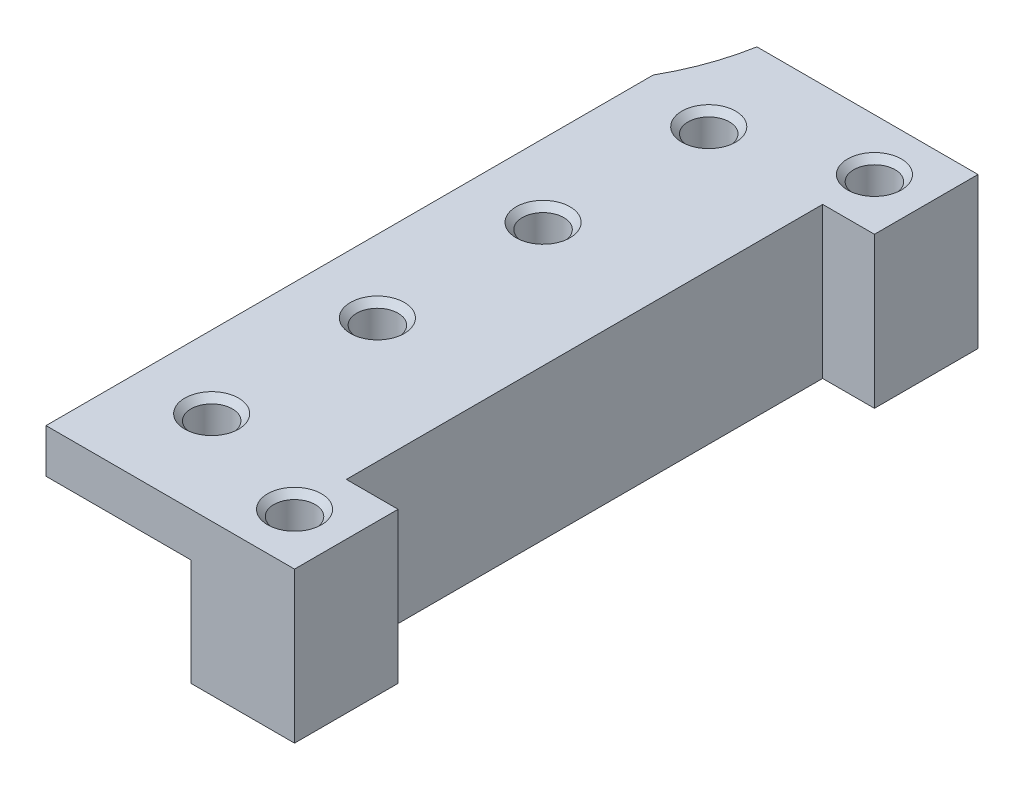
ISO-10303-21;
HEADER;
FILE_DESCRIPTION(('STEP AP214'),'2;1');
FILE_NAME('part.step','',(''),(''),'','','');
FILE_SCHEMA(('AUTOMOTIVE_DESIGN { 1 0 10303 214 1 1 1 1 }'));
ENDSEC;
DATA;
#1=APPLICATION_CONTEXT('core data for automotive mechanical design processes');
#2=APPLICATION_PROTOCOL_DEFINITION('international standard','automotive_design',2000,#1);
#3=PRODUCT_CONTEXT('',#1,'mechanical');
#4=PRODUCT('Part','Part','',(#3));
#5=PRODUCT_RELATED_PRODUCT_CATEGORY('part','',(#4));
#6=PRODUCT_DEFINITION_FORMATION('','',#4);
#7=PRODUCT_DEFINITION_CONTEXT('part definition',#1,'design');
#8=PRODUCT_DEFINITION('design','',#6,#7);
#9=PRODUCT_DEFINITION_SHAPE('','',#8);
#10=(LENGTH_UNIT() NAMED_UNIT(*) SI_UNIT(.MILLI.,.METRE.));
#11=(NAMED_UNIT(*) PLANE_ANGLE_UNIT() SI_UNIT($,.RADIAN.));
#12=(NAMED_UNIT(*) SI_UNIT($,.STERADIAN.) SOLID_ANGLE_UNIT());
#13=UNCERTAINTY_MEASURE_WITH_UNIT(LENGTH_MEASURE(1.E-05),#10,'distance_accuracy_value','');
#14=(GEOMETRIC_REPRESENTATION_CONTEXT(3) GLOBAL_UNCERTAINTY_ASSIGNED_CONTEXT((#13)) GLOBAL_UNIT_ASSIGNED_CONTEXT((#10,
#11,#12)) REPRESENTATION_CONTEXT('',''));
#15=CARTESIAN_POINT('',(0.,0.,0.));
#16=DIRECTION('',(0.,0.,1.));
#17=DIRECTION('',(1.,0.,0.));
#18=AXIS2_PLACEMENT_3D('',#15,#16,#17);
#19=CARTESIAN_POINT('',(0.,8.28,21.5));
#20=DIRECTION('',(0.,0.,1.));
#21=DIRECTION('',(1.,0.,0.));
#22=AXIS2_PLACEMENT_3D('',#19,#20,#21);
#23=PLANE('',#22);
#24=DIRECTION('',(0.,-1.,0.));
#25=VECTOR('',#24,1.);
#26=CARTESIAN_POINT('',(22.,8.28,21.5));
#27=LINE('',#26,#25);
#28=CARTESIAN_POINT('',(22.,7.28,21.5));
#29=VERTEX_POINT('',#28);
#30=CARTESIAN_POINT('',(22.,0.,21.5));
#31=VERTEX_POINT('',#30);
#32=EDGE_CURVE('E11',#29,#31,#27,.T.);
#33=ORIENTED_EDGE('',*,*,#32,.F.);
#34=DIRECTION('',(1.,0.,0.));
#35=VECTOR('',#34,1.);
#36=CARTESIAN_POINT('',(22.,7.28,21.5));
#37=LINE('',#36,#35);
#38=CARTESIAN_POINT('',(10.,7.28,21.5));
#39=VERTEX_POINT('',#38);
#40=EDGE_CURVE('E184',#39,#29,#37,.T.);
#41=ORIENTED_EDGE('',*,*,#40,.F.);
#42=DIRECTION('',(0.,-1.,0.));
#43=VECTOR('',#42,1.);
#44=CARTESIAN_POINT('',(10.,8.28,21.5));
#45=LINE('',#44,#43);
#46=CARTESIAN_POINT('',(10.,5.16,21.5));
#47=VERTEX_POINT('',#46);
#48=EDGE_CURVE('E231',#39,#47,#45,.T.);
#49=ORIENTED_EDGE('',*,*,#48,.T.);
#50=DIRECTION('',(-1.,0.,0.));
#51=VECTOR('',#50,1.);
#52=CARTESIAN_POINT('',(10.,5.16,21.5));
#53=LINE('',#52,#51);
#54=CARTESIAN_POINT('',(17.,5.16,21.5));
#55=VERTEX_POINT('',#54);
#56=EDGE_CURVE('E197',#55,#47,#53,.T.);
#57=ORIENTED_EDGE('',*,*,#56,.F.);
#58=DIRECTION('',(0.,1.,0.));
#59=VECTOR('',#58,1.);
#60=CARTESIAN_POINT('',(17.,0.,21.5));
#61=LINE('',#60,#59);
#62=CARTESIAN_POINT('',(17.,0.,21.5));
#63=VERTEX_POINT('',#62);
#64=EDGE_CURVE('E194',#63,#55,#61,.T.);
#65=ORIENTED_EDGE('',*,*,#64,.F.);
#66=DIRECTION('',(-1.,0.,0.));
#67=VECTOR('',#66,1.);
#68=CARTESIAN_POINT('',(0.,0.,21.5));
#69=LINE('',#68,#67);
#70=EDGE_CURVE('E213',#31,#63,#69,.T.);
#71=ORIENTED_EDGE('',*,*,#70,.F.);
#72=EDGE_LOOP('',(#33,#41,#49,#57,#65,#71));
#73=FACE_BOUND('',#72,.T.);
#74=ADVANCED_FACE('F34',(#73),#23,.T.);
#75=CARTESIAN_POINT('',(22.,8.28,0.));
#76=DIRECTION('',(-1.,0.,0.));
#77=DIRECTION('',(0.,0.,1.));
#78=AXIS2_PLACEMENT_3D('',#75,#76,#77);
#79=PLANE('',#78);
#80=DIRECTION('',(0.,0.,-1.));
#81=VECTOR('',#80,1.);
#82=CARTESIAN_POINT('',(22.,7.28,21.5));
#83=LINE('',#82,#81);
#84=CARTESIAN_POINT('',(22.,7.28,16.5));
#85=VERTEX_POINT('',#84);
#86=EDGE_CURVE('E124',#29,#85,#83,.T.);
#87=ORIENTED_EDGE('',*,*,#86,.F.);
#88=ORIENTED_EDGE('',*,*,#32,.T.);
#89=DIRECTION('',(0.,0.,-1.));
#90=VECTOR('',#89,1.);
#91=CARTESIAN_POINT('',(22.,0.,0.));
#92=LINE('',#91,#90);
#93=CARTESIAN_POINT('',(22.,0.,16.5));
#94=VERTEX_POINT('',#93);
#95=EDGE_CURVE('E216',#31,#94,#92,.T.);
#96=ORIENTED_EDGE('',*,*,#95,.T.);
#97=DIRECTION('',(0.,-1.,0.));
#98=VECTOR('',#97,1.);
#99=CARTESIAN_POINT('',(22.,8.28,16.5));
#100=LINE('',#99,#98);
#101=EDGE_CURVE('E42',#85,#94,#100,.T.);
#102=ORIENTED_EDGE('',*,*,#101,.F.);
#103=EDGE_LOOP('',(#87,#88,#96,#102));
#104=FACE_BOUND('',#103,.T.);
#105=ADVANCED_FACE('F254',(#104),#79,.F.);
#106=CARTESIAN_POINT('',(0.,8.28,16.5));
#107=DIRECTION('',(0.,0.,-1.));
#108=DIRECTION('',(-1.,0.,0.));
#109=AXIS2_PLACEMENT_3D('',#106,#107,#108);
#110=PLANE('',#109);
#111=DIRECTION('',(0.,-1.,0.));
#112=VECTOR('',#111,1.);
#113=CARTESIAN_POINT('',(19.5,8.28,16.5));
#114=LINE('',#113,#112);
#115=CARTESIAN_POINT('',(19.5,7.28,16.5));
#116=VERTEX_POINT('',#115);
#117=CARTESIAN_POINT('',(19.5,0.,16.5));
#118=VERTEX_POINT('',#117);
#119=EDGE_CURVE('E150',#116,#118,#114,.T.);
#120=ORIENTED_EDGE('',*,*,#119,.F.);
#121=DIRECTION('',(1.,0.,0.));
#122=VECTOR('',#121,1.);
#123=CARTESIAN_POINT('',(0.,7.28,16.5));
#124=LINE('',#123,#122);
#125=EDGE_CURVE('E191',#116,#85,#124,.T.);
#126=ORIENTED_EDGE('',*,*,#125,.T.);
#127=ORIENTED_EDGE('',*,*,#101,.T.);
#128=DIRECTION('',(1.,0.,0.));
#129=VECTOR('',#128,1.);
#130=CARTESIAN_POINT('',(0.,0.,16.5));
#131=LINE('',#130,#129);
#132=EDGE_CURVE('E219',#118,#94,#131,.T.);
#133=ORIENTED_EDGE('',*,*,#132,.F.);
#134=EDGE_LOOP('',(#120,#126,#127,#133));
#135=FACE_BOUND('',#134,.T.);
#136=ADVANCED_FACE('F259',(#135),#110,.T.);
#137=CARTESIAN_POINT('',(19.5,8.28,0.));
#138=DIRECTION('',(1.,0.,0.));
#139=DIRECTION('',(0.,0.,-1.));
#140=AXIS2_PLACEMENT_3D('',#137,#138,#139);
#141=PLANE('',#140);
#142=DIRECTION('',(0.,-1.,0.));
#143=VECTOR('',#142,1.);
#144=CARTESIAN_POINT('',(19.5,8.28,-6.5));
#145=LINE('',#144,#143);
#146=CARTESIAN_POINT('',(19.5,7.28,-6.5));
#147=VERTEX_POINT('',#146);
#148=CARTESIAN_POINT('',(19.5,0.,-6.5));
#149=VERTEX_POINT('',#148);
#150=EDGE_CURVE('E143',#147,#149,#145,.T.);
#151=ORIENTED_EDGE('',*,*,#150,.F.);
#152=DIRECTION('',(0.,0.,1.));
#153=VECTOR('',#152,1.);
#154=CARTESIAN_POINT('',(19.5,7.28,0.));
#155=LINE('',#154,#153);
#156=EDGE_CURVE('E188',#147,#116,#155,.T.);
#157=ORIENTED_EDGE('',*,*,#156,.T.);
#158=ORIENTED_EDGE('',*,*,#119,.T.);
#159=DIRECTION('',(0.,0.,1.));
#160=VECTOR('',#159,1.);
#161=CARTESIAN_POINT('',(19.5,0.,0.));
#162=LINE('',#161,#160);
#163=EDGE_CURVE('E222',#149,#118,#162,.T.);
#164=ORIENTED_EDGE('',*,*,#163,.F.);
#165=EDGE_LOOP('',(#151,#157,#158,#164));
#166=FACE_BOUND('',#165,.T.);
#167=ADVANCED_FACE('F276',(#166),#141,.T.);
#168=CARTESIAN_POINT('',(0.,8.28,-6.5));
#169=DIRECTION('',(0.,0.,-1.));
#170=DIRECTION('',(-1.,0.,0.));
#171=AXIS2_PLACEMENT_3D('',#168,#169,#170);
#172=PLANE('',#171);
#173=DIRECTION('',(1.,0.,0.));
#174=VECTOR('',#173,1.);
#175=CARTESIAN_POINT('',(0.,7.28,-6.5));
#176=LINE('',#175,#174);
#177=CARTESIAN_POINT('',(22.,7.28,-6.5));
#178=VERTEX_POINT('',#177);
#179=EDGE_CURVE('E120',#147,#178,#176,.T.);
#180=ORIENTED_EDGE('',*,*,#179,.F.);
#181=ORIENTED_EDGE('',*,*,#150,.T.);
#182=DIRECTION('',(1.,0.,0.));
#183=VECTOR('',#182,1.);
#184=CARTESIAN_POINT('',(0.,0.,-6.5));
#185=LINE('',#184,#183);
#186=CARTESIAN_POINT('',(22.,0.,-6.5));
#187=VERTEX_POINT('',#186);
#188=EDGE_CURVE('E225',#149,#187,#185,.T.);
#189=ORIENTED_EDGE('',*,*,#188,.T.);
#190=DIRECTION('',(0.,-1.,0.));
#191=VECTOR('',#190,1.);
#192=CARTESIAN_POINT('',(22.,8.28,-6.5));
#193=LINE('',#192,#191);
#194=EDGE_CURVE('E141',#178,#187,#193,.T.);
#195=ORIENTED_EDGE('',*,*,#194,.F.);
#196=EDGE_LOOP('',(#180,#181,#189,#195));
#197=FACE_BOUND('',#196,.T.);
#198=ADVANCED_FACE('F278',(#197),#172,.F.);
#199=CARTESIAN_POINT('',(22.,8.28,0.));
#200=DIRECTION('',(1.,0.,0.));
#201=DIRECTION('',(0.,0.,-1.));
#202=AXIS2_PLACEMENT_3D('',#199,#200,#201);
#203=PLANE('',#202);
#204=DIRECTION('',(0.,-1.,0.));
#205=VECTOR('',#204,1.);
#206=CARTESIAN_POINT('',(22.,8.28,-11.5));
#207=LINE('',#206,#205);
#208=CARTESIAN_POINT('',(22.,7.28,-11.5));
#209=VERTEX_POINT('',#208);
#210=CARTESIAN_POINT('',(22.,0.,-11.5));
#211=VERTEX_POINT('',#210);
#212=EDGE_CURVE('E131',#209,#211,#207,.T.);
#213=ORIENTED_EDGE('',*,*,#212,.F.);
#214=EDGE_CURVE('E115',#178,#209,#83,.T.);
#215=ORIENTED_EDGE('',*,*,#214,.F.);
#216=ORIENTED_EDGE('',*,*,#194,.T.);
#217=DIRECTION('',(0.,0.,1.));
#218=VECTOR('',#217,1.);
#219=CARTESIAN_POINT('',(22.,0.,0.));
#220=LINE('',#219,#218);
#221=EDGE_CURVE('E140',#211,#187,#220,.T.);
#222=ORIENTED_EDGE('',*,*,#221,.F.);
#223=EDGE_LOOP('',(#213,#215,#216,#222));
#224=FACE_BOUND('',#223,.T.);
#225=ADVANCED_FACE('F138',(#224),#203,.T.);
#226=CARTESIAN_POINT('',(0.,8.28,-11.5));
#227=DIRECTION('',(0.,0.,1.));
#228=DIRECTION('',(1.,0.,0.));
#229=AXIS2_PLACEMENT_3D('',#226,#227,#228);
#230=PLANE('',#229);
#231=DIRECTION('',(-1.,0.,0.));
#232=VECTOR('',#231,1.);
#233=CARTESIAN_POINT('',(22.,7.28,-11.5));
#234=LINE('',#233,#232);
#235=CARTESIAN_POINT('',(11.3247516529061,7.28,-11.5));
#236=VERTEX_POINT('',#235);
#237=EDGE_CURVE('E118',#209,#236,#234,.T.);
#238=ORIENTED_EDGE('',*,*,#237,.F.);
#239=ORIENTED_EDGE('',*,*,#212,.T.);
#240=DIRECTION('',(-1.,0.,0.));
#241=VECTOR('',#240,1.);
#242=CARTESIAN_POINT('',(0.,0.,-11.5));
#243=LINE('',#242,#241);
#244=CARTESIAN_POINT('',(17.,0.,-11.5));
#245=VERTEX_POINT('',#244);
#246=EDGE_CURVE('E229',#211,#245,#243,.T.);
#247=ORIENTED_EDGE('',*,*,#246,.T.);
#248=DIRECTION('',(0.,1.,0.));
#249=VECTOR('',#248,1.);
#250=CARTESIAN_POINT('',(17.,0.,-11.5));
#251=LINE('',#250,#249);
#252=CARTESIAN_POINT('',(17.,5.16,-11.5));
#253=VERTEX_POINT('',#252);
#254=EDGE_CURVE('E58',#245,#253,#251,.T.);
#255=ORIENTED_EDGE('',*,*,#254,.T.);
#256=DIRECTION('',(-1.,0.,0.));
#257=VECTOR('',#256,1.);
#258=CARTESIAN_POINT('',(10.,5.16,-11.5));
#259=LINE('',#258,#257);
#260=CARTESIAN_POINT('',(11.3247516529061,5.16,-11.5));
#261=VERTEX_POINT('',#260);
#262=EDGE_CURVE('E196',#253,#261,#259,.T.);
#263=ORIENTED_EDGE('',*,*,#262,.T.);
#264=DIRECTION('',(0.,-1.,0.));
#265=VECTOR('',#264,1.);
#266=CARTESIAN_POINT('',(11.3247516529061,8.28,-11.5));
#267=LINE('',#266,#265);
#268=EDGE_CURVE('E134',#236,#261,#267,.T.);
#269=ORIENTED_EDGE('',*,*,#268,.F.);
#270=EDGE_LOOP('',(#238,#239,#247,#255,#263,#269));
#271=FACE_BOUND('',#270,.T.);
#272=ADVANCED_FACE('F129',(#271),#230,.F.);
#273=CARTESIAN_POINT('',(0.,8.28,-13.5));
#274=DIRECTION('',(0.,-1.,0.));
#275=DIRECTION('',(0.,0.,-1.));
#276=AXIS2_PLACEMENT_3D('',#273,#274,#275);
#277=CYLINDRICAL_SURFACE('',#276,11.5);
#278=DIRECTION('',(0.,-1.,0.));
#279=VECTOR('',#278,1.);
#280=CARTESIAN_POINT('',(10.,8.28,-7.82109165419974));
#281=LINE('',#280,#279);
#282=CARTESIAN_POINT('',(10.,7.28,-7.82109165419974));
#283=VERTEX_POINT('',#282);
#284=CARTESIAN_POINT('',(10.,5.16,-7.82109165419974));
#285=VERTEX_POINT('',#284);
#286=EDGE_CURVE('E145',#283,#285,#281,.T.);
#287=ORIENTED_EDGE('',*,*,#286,.F.);
#288=CARTESIAN_POINT('',(0.,7.28,-13.5));
#289=DIRECTION('',(0.,1.,0.));
#290=DIRECTION('',(0.,0.,1.));
#291=AXIS2_PLACEMENT_3D('',#288,#289,#290);
#292=CIRCLE('',#291,11.5);
#293=EDGE_CURVE('E50',#283,#236,#292,.T.);
#294=ORIENTED_EDGE('',*,*,#293,.T.);
#295=ORIENTED_EDGE('',*,*,#268,.T.);
#296=CARTESIAN_POINT('',(0.,5.16,-13.5));
#297=DIRECTION('',(0.,1.,0.));
#298=DIRECTION('',(0.,0.,1.));
#299=AXIS2_PLACEMENT_3D('',#296,#297,#298);
#300=CIRCLE('',#299,11.5);
#301=EDGE_CURVE('E207',#285,#261,#300,.T.);
#302=ORIENTED_EDGE('',*,*,#301,.F.);
#303=EDGE_LOOP('',(#287,#294,#295,#302));
#304=FACE_BOUND('',#303,.T.);
#305=ADVANCED_FACE('F243',(#304),#277,.F.);
#306=CARTESIAN_POINT('',(10.,8.28,0.));
#307=DIRECTION('',(-1.,0.,0.));
#308=DIRECTION('',(0.,0.,1.));
#309=AXIS2_PLACEMENT_3D('',#306,#307,#308);
#310=PLANE('',#309);
#311=ORIENTED_EDGE('',*,*,#48,.F.);
#312=DIRECTION('',(0.,0.,1.));
#313=VECTOR('',#312,1.);
#314=CARTESIAN_POINT('',(10.,7.28,21.5));
#315=LINE('',#314,#313);
#316=EDGE_CURVE('E135',#283,#39,#315,.T.);
#317=ORIENTED_EDGE('',*,*,#316,.F.);
#318=ORIENTED_EDGE('',*,*,#286,.T.);
#319=DIRECTION('',(0.,0.,1.));
#320=VECTOR('',#319,1.);
#321=CARTESIAN_POINT('',(10.,5.16,-11.5));
#322=LINE('',#321,#320);
#323=EDGE_CURVE('E204',#285,#47,#322,.T.);
#324=ORIENTED_EDGE('',*,*,#323,.T.);
#325=EDGE_LOOP('',(#311,#317,#318,#324));
#326=FACE_BOUND('',#325,.T.);
#327=ADVANCED_FACE('F236',(#326),#310,.T.);
#328=CARTESIAN_POINT('',(0.,0.,0.));
#329=DIRECTION('',(0.,1.,0.));
#330=DIRECTION('',(0.,0.,1.));
#331=AXIS2_PLACEMENT_3D('',#328,#329,#330);
#332=PLANE('',#331);
#333=CARTESIAN_POINT('',(19.5,0.,19.));
#334=DIRECTION('',(0.,1.,0.));
#335=DIRECTION('',(0.,0.,1.));
#336=AXIS2_PLACEMENT_3D('',#333,#334,#335);
#337=CIRCLE('',#336,0.999999999999997);
#338=CARTESIAN_POINT('',(19.5,0.,20.));
#339=VERTEX_POINT('',#338);
#340=EDGE_CURVE('E299',#339,#339,#337,.T.);
#341=ORIENTED_EDGE('',*,*,#340,.T.);
#342=EDGE_LOOP('',(#341));
#343=FACE_BOUND('',#342,.T.);
#344=CARTESIAN_POINT('',(19.5,0.,-9.));
#345=DIRECTION('',(0.,1.,0.));
#346=DIRECTION('',(0.,0.,1.));
#347=AXIS2_PLACEMENT_3D('',#344,#345,#346);
#348=CIRCLE('',#347,0.999999999999997);
#349=CARTESIAN_POINT('',(19.5,0.,-8.));
#350=VERTEX_POINT('',#349);
#351=EDGE_CURVE('E302',#350,#350,#348,.T.);
#352=ORIENTED_EDGE('',*,*,#351,.T.);
#353=EDGE_LOOP('',(#352));
#354=FACE_BOUND('',#353,.T.);
#355=ORIENTED_EDGE('',*,*,#70,.T.);
#356=DIRECTION('',(0.,0.,1.));
#357=VECTOR('',#356,1.);
#358=CARTESIAN_POINT('',(17.,0.,-11.5));
#359=LINE('',#358,#357);
#360=EDGE_CURVE('E199',#245,#63,#359,.T.);
#361=ORIENTED_EDGE('',*,*,#360,.F.);
#362=ORIENTED_EDGE('',*,*,#246,.F.);
#363=ORIENTED_EDGE('',*,*,#221,.T.);
#364=ORIENTED_EDGE('',*,*,#188,.F.);
#365=ORIENTED_EDGE('',*,*,#163,.T.);
#366=ORIENTED_EDGE('',*,*,#132,.T.);
#367=ORIENTED_EDGE('',*,*,#95,.F.);
#368=EDGE_LOOP('',(#355,#361,#362,#363,#364,#365,#366,#367));
#369=FACE_BOUND('',#368,.T.);
#370=ADVANCED_FACE('F250',(#343,#354,#369),#332,.F.);
#371=CARTESIAN_POINT('',(10.,5.16,-11.5));
#372=DIRECTION('',(0.,1.,0.));
#373=DIRECTION('',(0.,0.,1.));
#374=AXIS2_PLACEMENT_3D('',#371,#372,#373);
#375=PLANE('',#374);
#376=CARTESIAN_POINT('',(13.5,5.16,17.));
#377=DIRECTION('',(0.,1.,0.));
#378=DIRECTION('',(0.,0.,1.));
#379=AXIS2_PLACEMENT_3D('',#376,#377,#378);
#380=CIRCLE('',#379,0.999999999999998);
#381=CARTESIAN_POINT('',(13.5,5.16,18.));
#382=VERTEX_POINT('',#381);
#383=EDGE_CURVE('E37',#382,#382,#380,.T.);
#384=ORIENTED_EDGE('',*,*,#383,.T.);
#385=EDGE_LOOP('',(#384));
#386=FACE_BOUND('',#385,.T.);
#387=CARTESIAN_POINT('',(13.5,5.16,9.));
#388=DIRECTION('',(0.,1.,0.));
#389=DIRECTION('',(0.,0.,1.));
#390=AXIS2_PLACEMENT_3D('',#387,#388,#389);
#391=CIRCLE('',#390,0.999999999999998);
#392=CARTESIAN_POINT('',(13.5,5.16,10.));
#393=VERTEX_POINT('',#392);
#394=EDGE_CURVE('E160',#393,#393,#391,.T.);
#395=ORIENTED_EDGE('',*,*,#394,.T.);
#396=EDGE_LOOP('',(#395));
#397=FACE_BOUND('',#396,.T.);
#398=CARTESIAN_POINT('',(13.5,5.16,1.));
#399=DIRECTION('',(0.,1.,0.));
#400=DIRECTION('',(0.,0.,1.));
#401=AXIS2_PLACEMENT_3D('',#398,#399,#400);
#402=CIRCLE('',#401,0.999999999999998);
#403=CARTESIAN_POINT('',(13.5,5.16,2.));
#404=VERTEX_POINT('',#403);
#405=EDGE_CURVE('E156',#404,#404,#402,.T.);
#406=ORIENTED_EDGE('',*,*,#405,.T.);
#407=EDGE_LOOP('',(#406));
#408=FACE_BOUND('',#407,.T.);
#409=CARTESIAN_POINT('',(13.5,5.16,-7.));
#410=DIRECTION('',(0.,1.,0.));
#411=DIRECTION('',(0.,0.,1.));
#412=AXIS2_PLACEMENT_3D('',#409,#410,#411);
#413=CIRCLE('',#412,0.999999999999998);
#414=CARTESIAN_POINT('',(13.5,5.16,-6.));
#415=VERTEX_POINT('',#414);
#416=EDGE_CURVE('E125',#415,#415,#413,.T.);
#417=ORIENTED_EDGE('',*,*,#416,.T.);
#418=EDGE_LOOP('',(#417));
#419=FACE_BOUND('',#418,.T.);
#420=ORIENTED_EDGE('',*,*,#301,.T.);
#421=ORIENTED_EDGE('',*,*,#262,.F.);
#422=DIRECTION('',(0.,0.,1.));
#423=VECTOR('',#422,1.);
#424=CARTESIAN_POINT('',(17.,5.16,-11.5));
#425=LINE('',#424,#423);
#426=EDGE_CURVE('E208',#253,#55,#425,.T.);
#427=ORIENTED_EDGE('',*,*,#426,.T.);
#428=ORIENTED_EDGE('',*,*,#56,.T.);
#429=ORIENTED_EDGE('',*,*,#323,.F.);
#430=EDGE_LOOP('',(#420,#421,#427,#428,#429));
#431=FACE_BOUND('',#430,.T.);
#432=ADVANCED_FACE('F240',(#386,#397,#408,#419,#431),#375,.F.);
#433=CARTESIAN_POINT('',(17.,0.,-11.5));
#434=DIRECTION('',(1.,0.,0.));
#435=DIRECTION('',(0.,0.,-1.));
#436=AXIS2_PLACEMENT_3D('',#433,#434,#435);
#437=PLANE('',#436);
#438=ORIENTED_EDGE('',*,*,#64,.T.);
#439=ORIENTED_EDGE('',*,*,#426,.F.);
#440=ORIENTED_EDGE('',*,*,#254,.F.);
#441=ORIENTED_EDGE('',*,*,#360,.T.);
#442=EDGE_LOOP('',(#438,#439,#440,#441));
#443=FACE_BOUND('',#442,.T.);
#444=ADVANCED_FACE('F279',(#443),#437,.F.);
#445=CARTESIAN_POINT('',(0.,7.28,0.));
#446=DIRECTION('',(0.,1.,0.));
#447=DIRECTION('',(0.,0.,1.));
#448=AXIS2_PLACEMENT_3D('',#445,#446,#447);
#449=PLANE('',#448);
#450=CARTESIAN_POINT('',(19.5,7.28,19.));
#451=DIRECTION('',(0.,1.,0.));
#452=DIRECTION('',(0.,0.,1.));
#453=AXIS2_PLACEMENT_3D('',#450,#451,#452);
#454=CIRCLE('',#453,1.3);
#455=CARTESIAN_POINT('',(19.5,7.28,20.3));
#456=VERTEX_POINT('',#455);
#457=EDGE_CURVE('E441',#456,#456,#454,.T.);
#458=ORIENTED_EDGE('',*,*,#457,.F.);
#459=EDGE_LOOP('',(#458));
#460=FACE_BOUND('',#459,.T.);
#461=CARTESIAN_POINT('',(19.5,7.28,-9.));
#462=DIRECTION('',(0.,1.,0.));
#463=DIRECTION('',(0.,0.,1.));
#464=AXIS2_PLACEMENT_3D('',#461,#462,#463);
#465=CIRCLE('',#464,1.3);
#466=CARTESIAN_POINT('',(19.5,7.28,-7.7));
#467=VERTEX_POINT('',#466);
#468=EDGE_CURVE('E311',#467,#467,#465,.T.);
#469=ORIENTED_EDGE('',*,*,#468,.F.);
#470=EDGE_LOOP('',(#469));
#471=FACE_BOUND('',#470,.T.);
#472=CARTESIAN_POINT('',(13.5,7.28,17.));
#473=DIRECTION('',(0.,1.,0.));
#474=DIRECTION('',(0.,0.,1.));
#475=AXIS2_PLACEMENT_3D('',#472,#473,#474);
#476=CIRCLE('',#475,1.3);
#477=CARTESIAN_POINT('',(13.5,7.28,18.3));
#478=VERTEX_POINT('',#477);
#479=EDGE_CURVE('E304',#478,#478,#476,.T.);
#480=ORIENTED_EDGE('',*,*,#479,.F.);
#481=EDGE_LOOP('',(#480));
#482=FACE_BOUND('',#481,.T.);
#483=CARTESIAN_POINT('',(13.5,7.28,9.));
#484=DIRECTION('',(0.,1.,0.));
#485=DIRECTION('',(0.,0.,1.));
#486=AXIS2_PLACEMENT_3D('',#483,#484,#485);
#487=CIRCLE('',#486,1.3);
#488=CARTESIAN_POINT('',(13.5,7.28,10.3));
#489=VERTEX_POINT('',#488);
#490=EDGE_CURVE('E169',#489,#489,#487,.T.);
#491=ORIENTED_EDGE('',*,*,#490,.F.);
#492=EDGE_LOOP('',(#491));
#493=FACE_BOUND('',#492,.T.);
#494=CARTESIAN_POINT('',(13.5,7.28,1.));
#495=DIRECTION('',(0.,1.,0.));
#496=DIRECTION('',(0.,0.,1.));
#497=AXIS2_PLACEMENT_3D('',#494,#495,#496);
#498=CIRCLE('',#497,1.3);
#499=CARTESIAN_POINT('',(13.5,7.28,2.3));
#500=VERTEX_POINT('',#499);
#501=EDGE_CURVE('E162',#500,#500,#498,.T.);
#502=ORIENTED_EDGE('',*,*,#501,.F.);
#503=EDGE_LOOP('',(#502));
#504=FACE_BOUND('',#503,.T.);
#505=CARTESIAN_POINT('',(13.5,7.28,-7.));
#506=DIRECTION('',(0.,1.,0.));
#507=DIRECTION('',(0.,0.,1.));
#508=AXIS2_PLACEMENT_3D('',#505,#506,#507);
#509=CIRCLE('',#508,1.3);
#510=CARTESIAN_POINT('',(13.5,7.28,-5.7));
#511=VERTEX_POINT('',#510);
#512=EDGE_CURVE('E158',#511,#511,#509,.T.);
#513=ORIENTED_EDGE('',*,*,#512,.F.);
#514=EDGE_LOOP('',(#513));
#515=FACE_BOUND('',#514,.T.);
#516=ORIENTED_EDGE('',*,*,#156,.F.);
#517=ORIENTED_EDGE('',*,*,#179,.T.);
#518=ORIENTED_EDGE('',*,*,#214,.T.);
#519=ORIENTED_EDGE('',*,*,#237,.T.);
#520=ORIENTED_EDGE('',*,*,#293,.F.);
#521=ORIENTED_EDGE('',*,*,#316,.T.);
#522=ORIENTED_EDGE('',*,*,#40,.T.);
#523=ORIENTED_EDGE('',*,*,#86,.T.);
#524=ORIENTED_EDGE('',*,*,#125,.F.);
#525=EDGE_LOOP('',(#516,#517,#518,#519,#520,#521,#522,#523,#524));
#526=FACE_BOUND('',#525,.T.);
#527=ADVANCED_FACE('F117',(#460,#471,#482,#493,#504,#515,#526),#449,.T.);
#528=CARTESIAN_POINT('',(13.5,7.28,-7.));
#529=DIRECTION('',(0.,1.,0.));
#530=DIRECTION('',(0.,0.,1.));
#531=AXIS2_PLACEMENT_3D('',#528,#529,#530);
#532=CYLINDRICAL_SURFACE('',#531,0.999999999999998);
#533=CARTESIAN_POINT('',(13.5,6.98,-7.));
#534=DIRECTION('',(0.,1.,0.));
#535=DIRECTION('',(0.,0.,1.));
#536=AXIS2_PLACEMENT_3D('',#533,#534,#535);
#537=CIRCLE('',#536,0.999999999999999);
#538=CARTESIAN_POINT('',(13.5,6.98,-6.));
#539=VERTEX_POINT('',#538);
#540=EDGE_CURVE('E155',#539,#539,#537,.T.);
#541=ORIENTED_EDGE('',*,*,#540,.T.);
#542=EDGE_LOOP('',(#541));
#543=FACE_BOUND('',#542,.T.);
#544=ORIENTED_EDGE('',*,*,#416,.F.);
#545=EDGE_LOOP('',(#544));
#546=FACE_BOUND('',#545,.T.);
#547=ADVANCED_FACE('F286',(#543,#546),#532,.F.);
#548=CARTESIAN_POINT('',(13.5,7.28,-7.));
#549=DIRECTION('',(0.,1.,0.));
#550=DIRECTION('',(0.,0.,1.));
#551=AXIS2_PLACEMENT_3D('',#548,#549,#550);
#552=CONICAL_SURFACE('',#551,1.3,0.785398163397451);
#553=ORIENTED_EDGE('',*,*,#540,.F.);
#554=EDGE_LOOP('',(#553));
#555=FACE_BOUND('',#554,.T.);
#556=ORIENTED_EDGE('',*,*,#512,.T.);
#557=EDGE_LOOP('',(#556));
#558=FACE_BOUND('',#557,.T.);
#559=ADVANCED_FACE('F346',(#555,#558),#552,.F.);
#560=CARTESIAN_POINT('',(13.5,7.28,1.));
#561=DIRECTION('',(0.,1.,0.));
#562=DIRECTION('',(0.,0.,1.));
#563=AXIS2_PLACEMENT_3D('',#560,#561,#562);
#564=CYLINDRICAL_SURFACE('',#563,0.999999999999998);
#565=CARTESIAN_POINT('',(13.5,6.98,1.));
#566=DIRECTION('',(0.,1.,0.));
#567=DIRECTION('',(0.,0.,1.));
#568=AXIS2_PLACEMENT_3D('',#565,#566,#567);
#569=CIRCLE('',#568,0.999999999999999);
#570=CARTESIAN_POINT('',(13.5,6.98,2.));
#571=VERTEX_POINT('',#570);
#572=EDGE_CURVE('E159',#571,#571,#569,.T.);
#573=ORIENTED_EDGE('',*,*,#572,.T.);
#574=EDGE_LOOP('',(#573));
#575=FACE_BOUND('',#574,.T.);
#576=ORIENTED_EDGE('',*,*,#405,.F.);
#577=EDGE_LOOP('',(#576));
#578=FACE_BOUND('',#577,.T.);
#579=ADVANCED_FACE('F342',(#575,#578),#564,.F.);
#580=CARTESIAN_POINT('',(13.5,7.28,1.));
#581=DIRECTION('',(0.,1.,0.));
#582=DIRECTION('',(0.,0.,1.));
#583=AXIS2_PLACEMENT_3D('',#580,#581,#582);
#584=CONICAL_SURFACE('',#583,1.3,0.785398163397451);
#585=ORIENTED_EDGE('',*,*,#572,.F.);
#586=EDGE_LOOP('',(#585));
#587=FACE_BOUND('',#586,.T.);
#588=ORIENTED_EDGE('',*,*,#501,.T.);
#589=EDGE_LOOP('',(#588));
#590=FACE_BOUND('',#589,.T.);
#591=ADVANCED_FACE('F339',(#587,#590),#584,.F.);
#592=CARTESIAN_POINT('',(13.5,7.28,9.));
#593=DIRECTION('',(0.,1.,0.));
#594=DIRECTION('',(0.,0.,1.));
#595=AXIS2_PLACEMENT_3D('',#592,#593,#594);
#596=CYLINDRICAL_SURFACE('',#595,0.999999999999998);
#597=CARTESIAN_POINT('',(13.5,6.98,9.));
#598=DIRECTION('',(0.,1.,0.));
#599=DIRECTION('',(0.,0.,1.));
#600=AXIS2_PLACEMENT_3D('',#597,#598,#599);
#601=CIRCLE('',#600,0.999999999999999);
#602=CARTESIAN_POINT('',(13.5,6.98,10.));
#603=VERTEX_POINT('',#602);
#604=EDGE_CURVE('E163',#603,#603,#601,.T.);
#605=ORIENTED_EDGE('',*,*,#604,.T.);
#606=EDGE_LOOP('',(#605));
#607=FACE_BOUND('',#606,.T.);
#608=ORIENTED_EDGE('',*,*,#394,.F.);
#609=EDGE_LOOP('',(#608));
#610=FACE_BOUND('',#609,.T.);
#611=ADVANCED_FACE('F332',(#607,#610),#596,.F.);
#612=CARTESIAN_POINT('',(13.5,7.28,9.));
#613=DIRECTION('',(0.,1.,0.));
#614=DIRECTION('',(0.,0.,1.));
#615=AXIS2_PLACEMENT_3D('',#612,#613,#614);
#616=CONICAL_SURFACE('',#615,1.3,0.785398163397451);
#617=ORIENTED_EDGE('',*,*,#604,.F.);
#618=EDGE_LOOP('',(#617));
#619=FACE_BOUND('',#618,.T.);
#620=ORIENTED_EDGE('',*,*,#490,.T.);
#621=EDGE_LOOP('',(#620));
#622=FACE_BOUND('',#621,.T.);
#623=ADVANCED_FACE('F323',(#619,#622),#616,.F.);
#624=CARTESIAN_POINT('',(13.5,7.28,17.));
#625=DIRECTION('',(0.,1.,0.));
#626=DIRECTION('',(0.,0.,1.));
#627=AXIS2_PLACEMENT_3D('',#624,#625,#626);
#628=CYLINDRICAL_SURFACE('',#627,0.999999999999998);
#629=CARTESIAN_POINT('',(13.5,6.98,17.));
#630=DIRECTION('',(0.,1.,0.));
#631=DIRECTION('',(0.,0.,1.));
#632=AXIS2_PLACEMENT_3D('',#629,#630,#631);
#633=CIRCLE('',#632,0.999999999999999);
#634=CARTESIAN_POINT('',(13.5,6.98,18.));
#635=VERTEX_POINT('',#634);
#636=EDGE_CURVE('E308',#635,#635,#633,.T.);
#637=ORIENTED_EDGE('',*,*,#636,.T.);
#638=EDGE_LOOP('',(#637));
#639=FACE_BOUND('',#638,.T.);
#640=ORIENTED_EDGE('',*,*,#383,.F.);
#641=EDGE_LOOP('',(#640));
#642=FACE_BOUND('',#641,.T.);
#643=ADVANCED_FACE('F320',(#639,#642),#628,.F.);
#644=CARTESIAN_POINT('',(13.5,7.28,17.));
#645=DIRECTION('',(0.,1.,0.));
#646=DIRECTION('',(0.,0.,1.));
#647=AXIS2_PLACEMENT_3D('',#644,#645,#646);
#648=CONICAL_SURFACE('',#647,1.3,0.785398163397451);
#649=ORIENTED_EDGE('',*,*,#636,.F.);
#650=EDGE_LOOP('',(#649));
#651=FACE_BOUND('',#650,.T.);
#652=ORIENTED_EDGE('',*,*,#479,.T.);
#653=EDGE_LOOP('',(#652));
#654=FACE_BOUND('',#653,.T.);
#655=ADVANCED_FACE('F322',(#651,#654),#648,.F.);
#656=CARTESIAN_POINT('',(19.5,7.28,-9.));
#657=DIRECTION('',(0.,1.,0.));
#658=DIRECTION('',(0.,0.,1.));
#659=AXIS2_PLACEMENT_3D('',#656,#657,#658);
#660=CYLINDRICAL_SURFACE('',#659,0.999999999999997);
#661=ORIENTED_EDGE('',*,*,#351,.F.);
#662=EDGE_LOOP('',(#661));
#663=FACE_BOUND('',#662,.T.);
#664=CARTESIAN_POINT('',(19.5,6.98,-9.));
#665=DIRECTION('',(0.,1.,0.));
#666=DIRECTION('',(0.,0.,1.));
#667=AXIS2_PLACEMENT_3D('',#664,#665,#666);
#668=CIRCLE('',#667,0.999999999999997);
#669=CARTESIAN_POINT('',(19.5,6.98,-8.));
#670=VERTEX_POINT('',#669);
#671=EDGE_CURVE('E305',#670,#670,#668,.T.);
#672=ORIENTED_EDGE('',*,*,#671,.T.);
#673=EDGE_LOOP('',(#672));
#674=FACE_BOUND('',#673,.T.);
#675=ADVANCED_FACE('F329',(#663,#674),#660,.F.);
#676=CARTESIAN_POINT('',(19.5,7.28,-9.));
#677=DIRECTION('',(0.,1.,0.));
#678=DIRECTION('',(0.,0.,1.));
#679=AXIS2_PLACEMENT_3D('',#676,#677,#678);
#680=CONICAL_SURFACE('',#679,1.3,0.785398163397451);
#681=ORIENTED_EDGE('',*,*,#671,.F.);
#682=EDGE_LOOP('',(#681));
#683=FACE_BOUND('',#682,.T.);
#684=ORIENTED_EDGE('',*,*,#468,.T.);
#685=EDGE_LOOP('',(#684));
#686=FACE_BOUND('',#685,.T.);
#687=ADVANCED_FACE('F403',(#683,#686),#680,.F.);
#688=CARTESIAN_POINT('',(19.5,7.28,19.));
#689=DIRECTION('',(0.,1.,0.));
#690=DIRECTION('',(0.,0.,1.));
#691=AXIS2_PLACEMENT_3D('',#688,#689,#690);
#692=CYLINDRICAL_SURFACE('',#691,0.999999999999997);
#693=ORIENTED_EDGE('',*,*,#340,.F.);
#694=EDGE_LOOP('',(#693));
#695=FACE_BOUND('',#694,.T.);
#696=CARTESIAN_POINT('',(19.5,6.98,19.));
#697=DIRECTION('',(0.,1.,0.));
#698=DIRECTION('',(0.,0.,1.));
#699=AXIS2_PLACEMENT_3D('',#696,#697,#698);
#700=CIRCLE('',#699,0.999999999999997);
#701=CARTESIAN_POINT('',(19.5,6.98,20.));
#702=VERTEX_POINT('',#701);
#703=EDGE_CURVE('E438',#702,#702,#700,.T.);
#704=ORIENTED_EDGE('',*,*,#703,.T.);
#705=EDGE_LOOP('',(#704));
#706=FACE_BOUND('',#705,.T.);
#707=ADVANCED_FACE('F411',(#695,#706),#692,.F.);
#708=CARTESIAN_POINT('',(19.5,7.28,19.));
#709=DIRECTION('',(0.,1.,0.));
#710=DIRECTION('',(0.,0.,1.));
#711=AXIS2_PLACEMENT_3D('',#708,#709,#710);
#712=CONICAL_SURFACE('',#711,1.3,0.785398163397451);
#713=ORIENTED_EDGE('',*,*,#703,.F.);
#714=EDGE_LOOP('',(#713));
#715=FACE_BOUND('',#714,.T.);
#716=ORIENTED_EDGE('',*,*,#457,.T.);
#717=EDGE_LOOP('',(#716));
#718=FACE_BOUND('',#717,.T.);
#719=ADVANCED_FACE('F421',(#715,#718),#712,.F.);
#720=CLOSED_SHELL('',(#74,#105,#136,#167,#198,#225,#272,#305,#327,#370,#432,#444,#527,#547,#559,
#579,#591,#611,#623,#643,#655,#675,#687,#707,#719));
#721=MANIFOLD_SOLID_BREP('B2',#720);
#722=ADVANCED_BREP_SHAPE_REPRESENTATION('',(#18,#721),#14);
#723=SHAPE_DEFINITION_REPRESENTATION(#9,#722);
ENDSEC;
END-ISO-10303-21;
